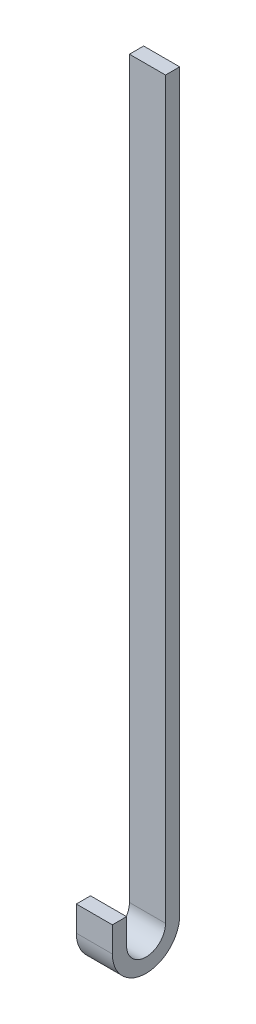
ISO-10303-21;
HEADER;
FILE_DESCRIPTION(('STEP AP214'),'2;1');
FILE_NAME('part.step','',(''),(''),'','','');
FILE_SCHEMA(('AUTOMOTIVE_DESIGN { 1 0 10303 214 1 1 1 1 }'));
ENDSEC;
DATA;
#1=APPLICATION_CONTEXT('core data for automotive mechanical design processes');
#2=APPLICATION_PROTOCOL_DEFINITION('international standard','automotive_design',2000,#1);
#3=PRODUCT_CONTEXT('',#1,'mechanical');
#4=PRODUCT('Part','Part','',(#3));
#5=PRODUCT_RELATED_PRODUCT_CATEGORY('part','',(#4));
#6=PRODUCT_DEFINITION_FORMATION('','',#4);
#7=PRODUCT_DEFINITION_CONTEXT('part definition',#1,'design');
#8=PRODUCT_DEFINITION('design','',#6,#7);
#9=PRODUCT_DEFINITION_SHAPE('','',#8);
#10=(LENGTH_UNIT() NAMED_UNIT(*) SI_UNIT(.MILLI.,.METRE.));
#11=(NAMED_UNIT(*) PLANE_ANGLE_UNIT() SI_UNIT($,.RADIAN.));
#12=(NAMED_UNIT(*) SI_UNIT($,.STERADIAN.) SOLID_ANGLE_UNIT());
#13=UNCERTAINTY_MEASURE_WITH_UNIT(LENGTH_MEASURE(1.E-05),#10,'distance_accuracy_value','');
#14=(GEOMETRIC_REPRESENTATION_CONTEXT(3) GLOBAL_UNCERTAINTY_ASSIGNED_CONTEXT((#13)) GLOBAL_UNIT_ASSIGNED_CONTEXT((#10,
#11,#12)) REPRESENTATION_CONTEXT('',''));
#15=CARTESIAN_POINT('',(0.,0.,0.));
#16=DIRECTION('',(0.,0.,1.));
#17=DIRECTION('',(1.,0.,0.));
#18=AXIS2_PLACEMENT_3D('',#15,#16,#17);
#19=CARTESIAN_POINT('',(38.1,0.,0.));
#20=DIRECTION('',(0.,-1.,0.));
#21=DIRECTION('',(0.,0.,-1.));
#22=AXIS2_PLACEMENT_3D('',#19,#20,#21);
#23=PLANE('',#22);
#24=DIRECTION('',(0.,0.,1.));
#25=VECTOR('',#24,1.);
#26=CARTESIAN_POINT('',(0.,0.,0.));
#27=LINE('',#26,#25);
#28=CARTESIAN_POINT('',(0.,0.,-14.986));
#29=VERTEX_POINT('',#28);
#30=CARTESIAN_POINT('',(0.,0.,0.));
#31=VERTEX_POINT('',#30);
#32=EDGE_CURVE('E161',#29,#31,#27,.T.);
#33=ORIENTED_EDGE('',*,*,#32,.T.);
#34=DIRECTION('',(-1.,0.,0.));
#35=VECTOR('',#34,1.);
#36=CARTESIAN_POINT('',(38.1,0.,0.));
#37=LINE('',#36,#35);
#38=CARTESIAN_POINT('',(38.1,0.,0.));
#39=VERTEX_POINT('',#38);
#40=EDGE_CURVE('E11',#39,#31,#37,.T.);
#41=ORIENTED_EDGE('',*,*,#40,.F.);
#42=DIRECTION('',(0.,0.,1.));
#43=VECTOR('',#42,1.);
#44=CARTESIAN_POINT('',(38.1,0.,0.));
#45=LINE('',#44,#43);
#46=CARTESIAN_POINT('',(38.1,0.,-14.986));
#47=VERTEX_POINT('',#46);
#48=EDGE_CURVE('E181',#47,#39,#45,.T.);
#49=ORIENTED_EDGE('',*,*,#48,.F.);
#50=DIRECTION('',(-1.,0.,0.));
#51=VECTOR('',#50,1.);
#52=CARTESIAN_POINT('',(38.1,0.,-14.986));
#53=LINE('',#52,#51);
#54=EDGE_CURVE('E157',#47,#29,#53,.T.);
#55=ORIENTED_EDGE('',*,*,#54,.T.);
#56=EDGE_LOOP('',(#33,#41,#49,#55));
#57=FACE_BOUND('',#56,.T.);
#58=ADVANCED_FACE('F47',(#57),#23,.F.);
#59=CARTESIAN_POINT('',(38.1,0.,0.));
#60=DIRECTION('',(0.,0.,-1.));
#61=DIRECTION('',(-1.,0.,0.));
#62=AXIS2_PLACEMENT_3D('',#59,#60,#61);
#63=PLANE('',#62);
#64=DIRECTION('',(0.,-1.,0.));
#65=VECTOR('',#64,1.);
#66=CARTESIAN_POINT('',(0.,0.,0.));
#67=LINE('',#66,#65);
#68=CARTESIAN_POINT('',(0.,-26.6924826191783,0.));
#69=VERTEX_POINT('',#68);
#70=EDGE_CURVE('E164',#31,#69,#67,.T.);
#71=ORIENTED_EDGE('',*,*,#70,.T.);
#72=DIRECTION('',(-1.,0.,0.));
#73=VECTOR('',#72,1.);
#74=CARTESIAN_POINT('',(38.1,-26.6924826191783,0.));
#75=LINE('',#74,#73);
#76=CARTESIAN_POINT('',(38.1,-26.6924826191783,0.));
#77=VERTEX_POINT('',#76);
#78=EDGE_CURVE('E56',#77,#69,#75,.T.);
#79=ORIENTED_EDGE('',*,*,#78,.F.);
#80=DIRECTION('',(0.,-1.,0.));
#81=VECTOR('',#80,1.);
#82=CARTESIAN_POINT('',(38.1,0.,0.));
#83=LINE('',#82,#81);
#84=EDGE_CURVE('E116',#39,#77,#83,.T.);
#85=ORIENTED_EDGE('',*,*,#84,.F.);
#86=ORIENTED_EDGE('',*,*,#40,.T.);
#87=EDGE_LOOP('',(#71,#79,#85,#86));
#88=FACE_BOUND('',#87,.T.);
#89=ADVANCED_FACE('F227',(#88),#63,.F.);
#90=CARTESIAN_POINT('',(38.1,-26.6924826191783,-35.56));
#91=DIRECTION('',(-1.,0.,0.));
#92=DIRECTION('',(0.,0.,1.));
#93=AXIS2_PLACEMENT_3D('',#90,#91,#92);
#94=CYLINDRICAL_SURFACE('',#93,35.56);
#95=CARTESIAN_POINT('',(0.,-26.6924826191783,-35.56));
#96=DIRECTION('',(1.,0.,0.));
#97=DIRECTION('',(0.,0.,-1.));
#98=AXIS2_PLACEMENT_3D('',#95,#96,#97);
#99=CIRCLE('',#98,35.56);
#100=CARTESIAN_POINT('',(0.,-26.6924826191783,-71.12));
#101=VERTEX_POINT('',#100);
#102=EDGE_CURVE('E166',#69,#101,#99,.T.);
#103=ORIENTED_EDGE('',*,*,#102,.T.);
#104=DIRECTION('',(-1.,0.,0.));
#105=VECTOR('',#104,1.);
#106=CARTESIAN_POINT('',(38.1,-26.6924826191783,-71.12));
#107=LINE('',#106,#105);
#108=CARTESIAN_POINT('',(38.1,-26.6924826191783,-71.12));
#109=VERTEX_POINT('',#108);
#110=EDGE_CURVE('E192',#109,#101,#107,.T.);
#111=ORIENTED_EDGE('',*,*,#110,.F.);
#112=CARTESIAN_POINT('',(38.1,-26.6924826191783,-35.56));
#113=DIRECTION('',(1.,0.,0.));
#114=DIRECTION('',(0.,0.,-1.));
#115=AXIS2_PLACEMENT_3D('',#112,#113,#114);
#116=CIRCLE('',#115,35.56);
#117=EDGE_CURVE('E203',#77,#109,#116,.T.);
#118=ORIENTED_EDGE('',*,*,#117,.F.);
#119=ORIENTED_EDGE('',*,*,#78,.T.);
#120=EDGE_LOOP('',(#103,#111,#118,#119));
#121=FACE_BOUND('',#120,.T.);
#122=ADVANCED_FACE('F201',(#121),#94,.T.);
#123=CARTESIAN_POINT('',(38.1,-26.6924826191783,-71.12));
#124=DIRECTION('',(0.,0.,1.));
#125=DIRECTION('',(1.,0.,0.));
#126=AXIS2_PLACEMENT_3D('',#123,#124,#125);
#127=PLANE('',#126);
#128=DIRECTION('',(0.,1.,0.));
#129=VECTOR('',#128,1.);
#130=CARTESIAN_POINT('',(0.,-26.6924826191783,-71.12));
#131=LINE('',#130,#129);
#132=CARTESIAN_POINT('',(0.,749.29999999999,-71.12));
#133=VERTEX_POINT('',#132);
#134=EDGE_CURVE('E169',#101,#133,#131,.T.);
#135=ORIENTED_EDGE('',*,*,#134,.T.);
#136=DIRECTION('',(-1.,0.,0.));
#137=VECTOR('',#136,1.);
#138=CARTESIAN_POINT('',(38.1,749.29999999999,-71.12));
#139=LINE('',#138,#137);
#140=CARTESIAN_POINT('',(38.1,749.29999999999,-71.12));
#141=VERTEX_POINT('',#140);
#142=EDGE_CURVE('E188',#141,#133,#139,.T.);
#143=ORIENTED_EDGE('',*,*,#142,.F.);
#144=DIRECTION('',(0.,1.,0.));
#145=VECTOR('',#144,1.);
#146=CARTESIAN_POINT('',(38.1,-26.6924826191783,-71.12));
#147=LINE('',#146,#145);
#148=EDGE_CURVE('E216',#109,#141,#147,.T.);
#149=ORIENTED_EDGE('',*,*,#148,.F.);
#150=ORIENTED_EDGE('',*,*,#110,.T.);
#151=EDGE_LOOP('',(#135,#143,#149,#150));
#152=FACE_BOUND('',#151,.T.);
#153=ADVANCED_FACE('F211',(#152),#127,.F.);
#154=CARTESIAN_POINT('',(38.1,749.29999999999,-56.134));
#155=DIRECTION('',(0.,-1.,0.));
#156=DIRECTION('',(0.,0.,-1.));
#157=AXIS2_PLACEMENT_3D('',#154,#155,#156);
#158=PLANE('',#157);
#159=DIRECTION('',(0.,0.,1.));
#160=VECTOR('',#159,1.);
#161=CARTESIAN_POINT('',(0.,749.29999999999,-56.134));
#162=LINE('',#161,#160);
#163=CARTESIAN_POINT('',(0.,749.29999999999,-56.134));
#164=VERTEX_POINT('',#163);
#165=EDGE_CURVE('E172',#133,#164,#162,.T.);
#166=ORIENTED_EDGE('',*,*,#165,.T.);
#167=DIRECTION('',(-1.,0.,0.));
#168=VECTOR('',#167,1.);
#169=CARTESIAN_POINT('',(38.1,749.29999999999,-56.134));
#170=LINE('',#169,#168);
#171=CARTESIAN_POINT('',(38.1,749.29999999999,-56.134));
#172=VERTEX_POINT('',#171);
#173=EDGE_CURVE('E150',#172,#164,#170,.T.);
#174=ORIENTED_EDGE('',*,*,#173,.F.);
#175=DIRECTION('',(0.,0.,1.));
#176=VECTOR('',#175,1.);
#177=CARTESIAN_POINT('',(38.1,749.29999999999,-56.134));
#178=LINE('',#177,#176);
#179=EDGE_CURVE('E139',#141,#172,#178,.T.);
#180=ORIENTED_EDGE('',*,*,#179,.F.);
#181=ORIENTED_EDGE('',*,*,#142,.T.);
#182=EDGE_LOOP('',(#166,#174,#180,#181));
#183=FACE_BOUND('',#182,.T.);
#184=ADVANCED_FACE('F214',(#183),#158,.F.);
#185=CARTESIAN_POINT('',(38.1,-26.6924826191783,-56.134));
#186=DIRECTION('',(0.,0.,-1.));
#187=DIRECTION('',(-1.,0.,0.));
#188=AXIS2_PLACEMENT_3D('',#185,#186,#187);
#189=PLANE('',#188);
#190=DIRECTION('',(0.,-1.,0.));
#191=VECTOR('',#190,1.);
#192=CARTESIAN_POINT('',(0.,-26.6924826191783,-56.134));
#193=LINE('',#192,#191);
#194=CARTESIAN_POINT('',(0.,-26.6924826191783,-56.134));
#195=VERTEX_POINT('',#194);
#196=EDGE_CURVE('E148',#164,#195,#193,.T.);
#197=ORIENTED_EDGE('',*,*,#196,.T.);
#198=DIRECTION('',(-1.,0.,0.));
#199=VECTOR('',#198,1.);
#200=CARTESIAN_POINT('',(38.1,-26.6924826191783,-56.134));
#201=LINE('',#200,#199);
#202=CARTESIAN_POINT('',(38.1,-26.6924826191783,-56.134));
#203=VERTEX_POINT('',#202);
#204=EDGE_CURVE('E145',#203,#195,#201,.T.);
#205=ORIENTED_EDGE('',*,*,#204,.F.);
#206=DIRECTION('',(0.,-1.,0.));
#207=VECTOR('',#206,1.);
#208=CARTESIAN_POINT('',(38.1,-26.6924826191783,-56.134));
#209=LINE('',#208,#207);
#210=EDGE_CURVE('E133',#172,#203,#209,.T.);
#211=ORIENTED_EDGE('',*,*,#210,.F.);
#212=ORIENTED_EDGE('',*,*,#173,.T.);
#213=EDGE_LOOP('',(#197,#205,#211,#212));
#214=FACE_BOUND('',#213,.T.);
#215=ADVANCED_FACE('F146',(#214),#189,.F.);
#216=CARTESIAN_POINT('',(38.1,-26.6924826191783,-35.56));
#217=DIRECTION('',(-1.,0.,0.));
#218=DIRECTION('',(0.,0.,1.));
#219=AXIS2_PLACEMENT_3D('',#216,#217,#218);
#220=CYLINDRICAL_SURFACE('',#219,20.574);
#221=CARTESIAN_POINT('',(0.,-26.6924826191783,-35.56));
#222=DIRECTION('',(-1.,0.,0.));
#223=DIRECTION('',(0.,0.,-1.));
#224=AXIS2_PLACEMENT_3D('',#221,#222,#223);
#225=CIRCLE('',#224,20.574);
#226=CARTESIAN_POINT('',(0.,-26.6924826191783,-14.986));
#227=VERTEX_POINT('',#226);
#228=EDGE_CURVE('E101',#195,#227,#225,.T.);
#229=ORIENTED_EDGE('',*,*,#228,.T.);
#230=DIRECTION('',(-1.,0.,0.));
#231=VECTOR('',#230,1.);
#232=CARTESIAN_POINT('',(38.1,-26.6924826191783,-14.986));
#233=LINE('',#232,#231);
#234=CARTESIAN_POINT('',(38.1,-26.6924826191783,-14.986));
#235=VERTEX_POINT('',#234);
#236=EDGE_CURVE('E151',#235,#227,#233,.T.);
#237=ORIENTED_EDGE('',*,*,#236,.F.);
#238=CARTESIAN_POINT('',(38.1,-26.6924826191783,-35.56));
#239=DIRECTION('',(-1.,0.,0.));
#240=DIRECTION('',(0.,0.,-1.));
#241=AXIS2_PLACEMENT_3D('',#238,#239,#240);
#242=CIRCLE('',#241,20.574);
#243=EDGE_CURVE('E137',#203,#235,#242,.T.);
#244=ORIENTED_EDGE('',*,*,#243,.F.);
#245=ORIENTED_EDGE('',*,*,#204,.T.);
#246=EDGE_LOOP('',(#229,#237,#244,#245));
#247=FACE_BOUND('',#246,.T.);
#248=ADVANCED_FACE('F153',(#247),#220,.F.);
#249=CARTESIAN_POINT('',(38.1,0.,-14.986));
#250=DIRECTION('',(0.,0.,1.));
#251=DIRECTION('',(1.,0.,0.));
#252=AXIS2_PLACEMENT_3D('',#249,#250,#251);
#253=PLANE('',#252);
#254=DIRECTION('',(0.,1.,0.));
#255=VECTOR('',#254,1.);
#256=CARTESIAN_POINT('',(0.,0.,-14.986));
#257=LINE('',#256,#255);
#258=EDGE_CURVE('E107',#227,#29,#257,.T.);
#259=ORIENTED_EDGE('',*,*,#258,.T.);
#260=ORIENTED_EDGE('',*,*,#54,.F.);
#261=DIRECTION('',(0.,1.,0.));
#262=VECTOR('',#261,1.);
#263=CARTESIAN_POINT('',(38.1,0.,-14.986));
#264=LINE('',#263,#262);
#265=EDGE_CURVE('E67',#235,#47,#264,.T.);
#266=ORIENTED_EDGE('',*,*,#265,.F.);
#267=ORIENTED_EDGE('',*,*,#236,.T.);
#268=EDGE_LOOP('',(#259,#260,#266,#267));
#269=FACE_BOUND('',#268,.T.);
#270=ADVANCED_FACE('F243',(#269),#253,.F.);
#271=CARTESIAN_POINT('',(38.1,-26.6924826191783,-35.56));
#272=DIRECTION('',(1.,0.,0.));
#273=DIRECTION('',(0.,0.,-1.));
#274=AXIS2_PLACEMENT_3D('',#271,#272,#273);
#275=PLANE('',#274);
#276=ORIENTED_EDGE('',*,*,#48,.T.);
#277=ORIENTED_EDGE('',*,*,#84,.T.);
#278=ORIENTED_EDGE('',*,*,#117,.T.);
#279=ORIENTED_EDGE('',*,*,#148,.T.);
#280=ORIENTED_EDGE('',*,*,#179,.T.);
#281=ORIENTED_EDGE('',*,*,#210,.T.);
#282=ORIENTED_EDGE('',*,*,#243,.T.);
#283=ORIENTED_EDGE('',*,*,#265,.T.);
#284=EDGE_LOOP('',(#276,#277,#278,#279,#280,#281,#282,#283));
#285=FACE_BOUND('',#284,.T.);
#286=ADVANCED_FACE('F135',(#285),#275,.T.);
#287=CARTESIAN_POINT('',(0.,-26.6924826191783,-35.56));
#288=DIRECTION('',(1.,0.,0.));
#289=DIRECTION('',(0.,0.,-1.));
#290=AXIS2_PLACEMENT_3D('',#287,#288,#289);
#291=PLANE('',#290);
#292=ORIENTED_EDGE('',*,*,#32,.F.);
#293=ORIENTED_EDGE('',*,*,#258,.F.);
#294=ORIENTED_EDGE('',*,*,#228,.F.);
#295=ORIENTED_EDGE('',*,*,#196,.F.);
#296=ORIENTED_EDGE('',*,*,#165,.F.);
#297=ORIENTED_EDGE('',*,*,#134,.F.);
#298=ORIENTED_EDGE('',*,*,#102,.F.);
#299=ORIENTED_EDGE('',*,*,#70,.F.);
#300=EDGE_LOOP('',(#292,#293,#294,#295,#296,#297,#298,#299));
#301=FACE_BOUND('',#300,.T.);
#302=ADVANCED_FACE('F207',(#301),#291,.F.);
#303=CLOSED_SHELL('',(#58,#89,#122,#153,#184,#215,#248,#270,#286,#302));
#304=MANIFOLD_SOLID_BREP('B2',#303);
#305=ADVANCED_BREP_SHAPE_REPRESENTATION('',(#18,#304),#14);
#306=SHAPE_DEFINITION_REPRESENTATION(#9,#305);
ENDSEC;
END-ISO-10303-21;
